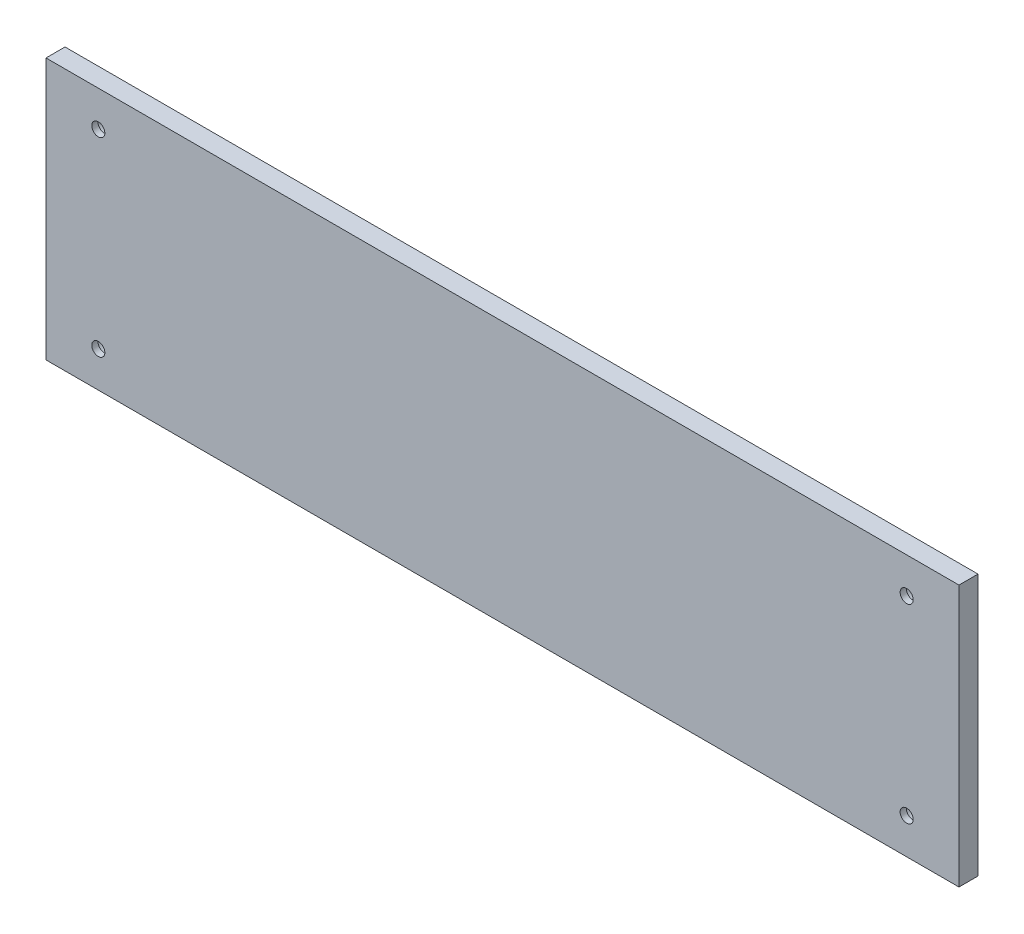
ISO-10303-21;
HEADER;
FILE_DESCRIPTION(('STEP AP214'),'2;1');
FILE_NAME('part.step','',(''),(''),'','','');
FILE_SCHEMA(('AUTOMOTIVE_DESIGN { 1 0 10303 214 1 1 1 1 }'));
ENDSEC;
DATA;
#1=APPLICATION_CONTEXT('core data for automotive mechanical design processes');
#2=APPLICATION_PROTOCOL_DEFINITION('international standard','automotive_design',2000,#1);
#3=PRODUCT_CONTEXT('',#1,'mechanical');
#4=PRODUCT('Part','Part','',(#3));
#5=PRODUCT_RELATED_PRODUCT_CATEGORY('part','',(#4));
#6=PRODUCT_DEFINITION_FORMATION('','',#4);
#7=PRODUCT_DEFINITION_CONTEXT('part definition',#1,'design');
#8=PRODUCT_DEFINITION('design','',#6,#7);
#9=PRODUCT_DEFINITION_SHAPE('','',#8);
#10=(LENGTH_UNIT() NAMED_UNIT(*) SI_UNIT(.MILLI.,.METRE.));
#11=(NAMED_UNIT(*) PLANE_ANGLE_UNIT() SI_UNIT($,.RADIAN.));
#12=(NAMED_UNIT(*) SI_UNIT($,.STERADIAN.) SOLID_ANGLE_UNIT());
#13=UNCERTAINTY_MEASURE_WITH_UNIT(LENGTH_MEASURE(1.E-05),#10,'distance_accuracy_value','');
#14=(GEOMETRIC_REPRESENTATION_CONTEXT(3) GLOBAL_UNCERTAINTY_ASSIGNED_CONTEXT((#13)) GLOBAL_UNIT_ASSIGNED_CONTEXT((#10,
#11,#12)) REPRESENTATION_CONTEXT('',''));
#15=CARTESIAN_POINT('',(0.,0.,0.));
#16=DIRECTION('',(0.,0.,1.));
#17=DIRECTION('',(1.,0.,0.));
#18=AXIS2_PLACEMENT_3D('',#15,#16,#17);
#19=CARTESIAN_POINT('',(0.,0.,8.));
#20=DIRECTION('',(1.,0.,0.));
#21=DIRECTION('',(0.,0.,-1.));
#22=AXIS2_PLACEMENT_3D('',#19,#20,#21);
#23=PLANE('',#22);
#24=DIRECTION('',(0.,-1.,0.));
#25=VECTOR('',#24,1.);
#26=CARTESIAN_POINT('',(0.,0.,0.));
#27=LINE('',#26,#25);
#28=CARTESIAN_POINT('',(0.,110.,0.));
#29=VERTEX_POINT('',#28);
#30=CARTESIAN_POINT('',(0.,0.,0.));
#31=VERTEX_POINT('',#30);
#32=EDGE_CURVE('E94',#29,#31,#27,.T.);
#33=ORIENTED_EDGE('',*,*,#32,.T.);
#34=DIRECTION('',(0.,0.,-1.));
#35=VECTOR('',#34,1.);
#36=CARTESIAN_POINT('',(0.,0.,8.));
#37=LINE('',#36,#35);
#38=CARTESIAN_POINT('',(0.,0.,8.));
#39=VERTEX_POINT('',#38);
#40=EDGE_CURVE('E11',#39,#31,#37,.T.);
#41=ORIENTED_EDGE('',*,*,#40,.F.);
#42=DIRECTION('',(0.,-1.,0.));
#43=VECTOR('',#42,1.);
#44=CARTESIAN_POINT('',(0.,0.,8.));
#45=LINE('',#44,#43);
#46=CARTESIAN_POINT('',(0.,110.,8.));
#47=VERTEX_POINT('',#46);
#48=EDGE_CURVE('E82',#47,#39,#45,.T.);
#49=ORIENTED_EDGE('',*,*,#48,.F.);
#50=DIRECTION('',(0.,0.,-1.));
#51=VECTOR('',#50,1.);
#52=CARTESIAN_POINT('',(0.,110.,8.));
#53=LINE('',#52,#51);
#54=EDGE_CURVE('E90',#47,#29,#53,.T.);
#55=ORIENTED_EDGE('',*,*,#54,.T.);
#56=EDGE_LOOP('',(#33,#41,#49,#55));
#57=FACE_BOUND('',#56,.T.);
#58=ADVANCED_FACE('F31',(#57),#23,.F.);
#59=CARTESIAN_POINT('',(0.,0.,8.));
#60=DIRECTION('',(0.,1.,0.));
#61=DIRECTION('',(0.,0.,1.));
#62=AXIS2_PLACEMENT_3D('',#59,#60,#61);
#63=PLANE('',#62);
#64=DIRECTION('',(1.,0.,0.));
#65=VECTOR('',#64,1.);
#66=CARTESIAN_POINT('',(0.,0.,0.));
#67=LINE('',#66,#65);
#68=CARTESIAN_POINT('',(384.,0.,0.));
#69=VERTEX_POINT('',#68);
#70=EDGE_CURVE('E86',#31,#69,#67,.T.);
#71=ORIENTED_EDGE('',*,*,#70,.T.);
#72=DIRECTION('',(0.,0.,-1.));
#73=VECTOR('',#72,1.);
#74=CARTESIAN_POINT('',(384.,0.,8.));
#75=LINE('',#74,#73);
#76=CARTESIAN_POINT('',(384.,0.,8.));
#77=VERTEX_POINT('',#76);
#78=EDGE_CURVE('E39',#77,#69,#75,.T.);
#79=ORIENTED_EDGE('',*,*,#78,.F.);
#80=DIRECTION('',(1.,0.,0.));
#81=VECTOR('',#80,1.);
#82=CARTESIAN_POINT('',(0.,0.,8.));
#83=LINE('',#82,#81);
#84=EDGE_CURVE('E77',#39,#77,#83,.T.);
#85=ORIENTED_EDGE('',*,*,#84,.F.);
#86=ORIENTED_EDGE('',*,*,#40,.T.);
#87=EDGE_LOOP('',(#71,#79,#85,#86));
#88=FACE_BOUND('',#87,.T.);
#89=ADVANCED_FACE('F85',(#88),#63,.F.);
#90=CARTESIAN_POINT('',(384.,0.,8.));
#91=DIRECTION('',(-1.,0.,0.));
#92=DIRECTION('',(0.,0.,1.));
#93=AXIS2_PLACEMENT_3D('',#90,#91,#92);
#94=PLANE('',#93);
#95=DIRECTION('',(0.,1.,0.));
#96=VECTOR('',#95,1.);
#97=CARTESIAN_POINT('',(384.,0.,0.));
#98=LINE('',#97,#96);
#99=CARTESIAN_POINT('',(384.,110.,0.));
#100=VERTEX_POINT('',#99);
#101=EDGE_CURVE('E64',#69,#100,#98,.T.);
#102=ORIENTED_EDGE('',*,*,#101,.T.);
#103=DIRECTION('',(0.,0.,-1.));
#104=VECTOR('',#103,1.);
#105=CARTESIAN_POINT('',(384.,110.,8.));
#106=LINE('',#105,#104);
#107=CARTESIAN_POINT('',(384.,110.,8.));
#108=VERTEX_POINT('',#107);
#109=EDGE_CURVE('E87',#108,#100,#106,.T.);
#110=ORIENTED_EDGE('',*,*,#109,.F.);
#111=DIRECTION('',(0.,1.,0.));
#112=VECTOR('',#111,1.);
#113=CARTESIAN_POINT('',(384.,0.,8.));
#114=LINE('',#113,#112);
#115=EDGE_CURVE('E80',#77,#108,#114,.T.);
#116=ORIENTED_EDGE('',*,*,#115,.F.);
#117=ORIENTED_EDGE('',*,*,#78,.T.);
#118=EDGE_LOOP('',(#102,#110,#116,#117));
#119=FACE_BOUND('',#118,.T.);
#120=ADVANCED_FACE('F88',(#119),#94,.F.);
#121=CARTESIAN_POINT('',(0.,110.,8.));
#122=DIRECTION('',(0.,-1.,0.));
#123=DIRECTION('',(0.,0.,-1.));
#124=AXIS2_PLACEMENT_3D('',#121,#122,#123);
#125=PLANE('',#124);
#126=DIRECTION('',(-1.,0.,0.));
#127=VECTOR('',#126,1.);
#128=CARTESIAN_POINT('',(0.,110.,0.));
#129=LINE('',#128,#127);
#130=EDGE_CURVE('E70',#100,#29,#129,.T.);
#131=ORIENTED_EDGE('',*,*,#130,.T.);
#132=ORIENTED_EDGE('',*,*,#54,.F.);
#133=DIRECTION('',(-1.,0.,0.));
#134=VECTOR('',#133,1.);
#135=CARTESIAN_POINT('',(0.,110.,8.));
#136=LINE('',#135,#134);
#137=EDGE_CURVE('E47',#108,#47,#136,.T.);
#138=ORIENTED_EDGE('',*,*,#137,.F.);
#139=ORIENTED_EDGE('',*,*,#109,.T.);
#140=EDGE_LOOP('',(#131,#132,#138,#139));
#141=FACE_BOUND('',#140,.T.);
#142=ADVANCED_FACE('F102',(#141),#125,.F.);
#143=CARTESIAN_POINT('',(0.,110.,8.));
#144=DIRECTION('',(0.,0.,-1.));
#145=DIRECTION('',(-1.,0.,0.));
#146=AXIS2_PLACEMENT_3D('',#143,#144,#145);
#147=PLANE('',#146);
#148=CARTESIAN_POINT('',(362.,95.,7.99999999999999));
#149=DIRECTION('',(0.,0.,-1.));
#150=DIRECTION('',(-1.,0.,0.));
#151=AXIS2_PLACEMENT_3D('',#148,#149,#150);
#152=CIRCLE('',#151,2.75000000000003);
#153=CARTESIAN_POINT('',(359.25,95.,7.99999999999999));
#154=VERTEX_POINT('',#153);
#155=EDGE_CURVE('E152',#154,#154,#152,.T.);
#156=ORIENTED_EDGE('',*,*,#155,.T.);
#157=EDGE_LOOP('',(#156));
#158=FACE_BOUND('',#157,.T.);
#159=CARTESIAN_POINT('',(22.,95.,7.99999999999999));
#160=DIRECTION('',(0.,0.,-1.));
#161=DIRECTION('',(-1.,0.,0.));
#162=AXIS2_PLACEMENT_3D('',#159,#160,#161);
#163=CIRCLE('',#162,2.75000000000001);
#164=CARTESIAN_POINT('',(19.25,95.,7.99999999999999));
#165=VERTEX_POINT('',#164);
#166=EDGE_CURVE('E140',#165,#165,#163,.T.);
#167=ORIENTED_EDGE('',*,*,#166,.T.);
#168=EDGE_LOOP('',(#167));
#169=FACE_BOUND('',#168,.T.);
#170=CARTESIAN_POINT('',(21.9999999999998,15.,7.99999999999999));
#171=DIRECTION('',(0.,0.,-1.));
#172=DIRECTION('',(-1.,0.,0.));
#173=AXIS2_PLACEMENT_3D('',#170,#171,#172);
#174=CIRCLE('',#173,2.75000000000001);
#175=CARTESIAN_POINT('',(19.2499999999998,15.,7.99999999999999));
#176=VERTEX_POINT('',#175);
#177=EDGE_CURVE('E128',#176,#176,#174,.T.);
#178=ORIENTED_EDGE('',*,*,#177,.T.);
#179=EDGE_LOOP('',(#178));
#180=FACE_BOUND('',#179,.T.);
#181=CARTESIAN_POINT('',(362.,15.,7.99999999999999));
#182=DIRECTION('',(0.,0.,-1.));
#183=DIRECTION('',(-1.,0.,0.));
#184=AXIS2_PLACEMENT_3D('',#181,#182,#183);
#185=CIRCLE('',#184,2.75000000000003);
#186=CARTESIAN_POINT('',(359.25,15.,7.99999999999999));
#187=VERTEX_POINT('',#186);
#188=EDGE_CURVE('E116',#187,#187,#185,.T.);
#189=ORIENTED_EDGE('',*,*,#188,.T.);
#190=EDGE_LOOP('',(#189));
#191=FACE_BOUND('',#190,.T.);
#192=ORIENTED_EDGE('',*,*,#48,.T.);
#193=ORIENTED_EDGE('',*,*,#84,.T.);
#194=ORIENTED_EDGE('',*,*,#115,.T.);
#195=ORIENTED_EDGE('',*,*,#137,.T.);
#196=EDGE_LOOP('',(#192,#193,#194,#195));
#197=FACE_BOUND('',#196,.T.);
#198=ADVANCED_FACE('F78',(#158,#169,#180,#191,#197),#147,.F.);
#199=CARTESIAN_POINT('',(0.,110.,0.));
#200=DIRECTION('',(0.,0.,-1.));
#201=DIRECTION('',(-1.,0.,0.));
#202=AXIS2_PLACEMENT_3D('',#199,#200,#201);
#203=PLANE('',#202);
#204=CARTESIAN_POINT('',(362.,95.,0.));
#205=DIRECTION('',(0.,0.,-1.));
#206=DIRECTION('',(-1.,0.,0.));
#207=AXIS2_PLACEMENT_3D('',#204,#205,#206);
#208=CIRCLE('',#207,5.);
#209=CARTESIAN_POINT('',(357.,95.,0.));
#210=VERTEX_POINT('',#209);
#211=EDGE_CURVE('E143',#210,#210,#208,.T.);
#212=ORIENTED_EDGE('',*,*,#211,.F.);
#213=EDGE_LOOP('',(#212));
#214=FACE_BOUND('',#213,.T.);
#215=CARTESIAN_POINT('',(22.,95.,0.));
#216=DIRECTION('',(0.,0.,-1.));
#217=DIRECTION('',(-1.,0.,0.));
#218=AXIS2_PLACEMENT_3D('',#215,#216,#217);
#219=CIRCLE('',#218,4.99999999999999);
#220=CARTESIAN_POINT('',(17.,95.,0.));
#221=VERTEX_POINT('',#220);
#222=EDGE_CURVE('E131',#221,#221,#219,.T.);
#223=ORIENTED_EDGE('',*,*,#222,.F.);
#224=EDGE_LOOP('',(#223));
#225=FACE_BOUND('',#224,.T.);
#226=CARTESIAN_POINT('',(21.9999999999998,15.,0.));
#227=DIRECTION('',(0.,0.,-1.));
#228=DIRECTION('',(-1.,0.,0.));
#229=AXIS2_PLACEMENT_3D('',#226,#227,#228);
#230=CIRCLE('',#229,4.99999999999999);
#231=CARTESIAN_POINT('',(16.9999999999998,15.,0.));
#232=VERTEX_POINT('',#231);
#233=EDGE_CURVE('E119',#232,#232,#230,.T.);
#234=ORIENTED_EDGE('',*,*,#233,.F.);
#235=EDGE_LOOP('',(#234));
#236=FACE_BOUND('',#235,.T.);
#237=CARTESIAN_POINT('',(362.,15.,0.));
#238=DIRECTION('',(0.,0.,-1.));
#239=DIRECTION('',(-1.,0.,0.));
#240=AXIS2_PLACEMENT_3D('',#237,#238,#239);
#241=CIRCLE('',#240,5.);
#242=CARTESIAN_POINT('',(357.,15.,0.));
#243=VERTEX_POINT('',#242);
#244=EDGE_CURVE('E97',#243,#243,#241,.T.);
#245=ORIENTED_EDGE('',*,*,#244,.F.);
#246=EDGE_LOOP('',(#245));
#247=FACE_BOUND('',#246,.T.);
#248=ORIENTED_EDGE('',*,*,#32,.F.);
#249=ORIENTED_EDGE('',*,*,#130,.F.);
#250=ORIENTED_EDGE('',*,*,#101,.F.);
#251=ORIENTED_EDGE('',*,*,#70,.F.);
#252=EDGE_LOOP('',(#248,#249,#250,#251));
#253=FACE_BOUND('',#252,.T.);
#254=ADVANCED_FACE('F105',(#214,#225,#236,#247,#253),#203,.T.);
#255=CARTESIAN_POINT('',(362.,15.,0.));
#256=DIRECTION('',(0.,0.,-1.));
#257=DIRECTION('',(-1.,0.,0.));
#258=AXIS2_PLACEMENT_3D('',#255,#256,#257);
#259=CYLINDRICAL_SURFACE('',#258,5.);
#260=CARTESIAN_POINT('',(362.,15.,5.4));
#261=DIRECTION('',(0.,0.,-1.));
#262=DIRECTION('',(-1.,0.,0.));
#263=AXIS2_PLACEMENT_3D('',#260,#261,#262);
#264=CIRCLE('',#263,5.);
#265=CARTESIAN_POINT('',(357.,15.,5.4));
#266=VERTEX_POINT('',#265);
#267=EDGE_CURVE('E110',#266,#266,#264,.T.);
#268=ORIENTED_EDGE('',*,*,#267,.F.);
#269=EDGE_LOOP('',(#268));
#270=FACE_BOUND('',#269,.T.);
#271=ORIENTED_EDGE('',*,*,#244,.T.);
#272=EDGE_LOOP('',(#271));
#273=FACE_BOUND('',#272,.T.);
#274=ADVANCED_FACE('F179',(#270,#273),#259,.F.);
#275=CARTESIAN_POINT('',(364.75,15.,5.4));
#276=DIRECTION('',(0.,0.,1.));
#277=DIRECTION('',(1.,0.,0.));
#278=AXIS2_PLACEMENT_3D('',#275,#276,#277);
#279=PLANE('',#278);
#280=CARTESIAN_POINT('',(362.,15.,5.4));
#281=DIRECTION('',(0.,0.,-1.));
#282=DIRECTION('',(-1.,0.,0.));
#283=AXIS2_PLACEMENT_3D('',#280,#281,#282);
#284=CIRCLE('',#283,2.75000000000003);
#285=CARTESIAN_POINT('',(359.25,15.,5.4));
#286=VERTEX_POINT('',#285);
#287=EDGE_CURVE('E113',#286,#286,#284,.T.);
#288=ORIENTED_EDGE('',*,*,#287,.F.);
#289=EDGE_LOOP('',(#288));
#290=FACE_BOUND('',#289,.T.);
#291=ORIENTED_EDGE('',*,*,#267,.T.);
#292=EDGE_LOOP('',(#291));
#293=FACE_BOUND('',#292,.T.);
#294=ADVANCED_FACE('F188',(#290,#293),#279,.F.);
#295=CARTESIAN_POINT('',(362.,15.,0.));
#296=DIRECTION('',(0.,0.,-1.));
#297=DIRECTION('',(-1.,0.,0.));
#298=AXIS2_PLACEMENT_3D('',#295,#296,#297);
#299=CYLINDRICAL_SURFACE('',#298,2.75000000000003);
#300=ORIENTED_EDGE('',*,*,#188,.F.);
#301=EDGE_LOOP('',(#300));
#302=FACE_BOUND('',#301,.T.);
#303=ORIENTED_EDGE('',*,*,#287,.T.);
#304=EDGE_LOOP('',(#303));
#305=FACE_BOUND('',#304,.T.);
#306=ADVANCED_FACE('F194',(#302,#305),#299,.F.);
#307=CARTESIAN_POINT('',(21.9999999999998,15.,0.));
#308=DIRECTION('',(0.,0.,-1.));
#309=DIRECTION('',(-1.,0.,0.));
#310=AXIS2_PLACEMENT_3D('',#307,#308,#309);
#311=CYLINDRICAL_SURFACE('',#310,4.99999999999999);
#312=CARTESIAN_POINT('',(21.9999999999998,15.,5.4));
#313=DIRECTION('',(0.,0.,-1.));
#314=DIRECTION('',(-1.,0.,0.));
#315=AXIS2_PLACEMENT_3D('',#312,#313,#314);
#316=CIRCLE('',#315,4.99999999999999);
#317=CARTESIAN_POINT('',(16.9999999999998,15.,5.4));
#318=VERTEX_POINT('',#317);
#319=EDGE_CURVE('E122',#318,#318,#316,.T.);
#320=ORIENTED_EDGE('',*,*,#319,.F.);
#321=EDGE_LOOP('',(#320));
#322=FACE_BOUND('',#321,.T.);
#323=ORIENTED_EDGE('',*,*,#233,.T.);
#324=EDGE_LOOP('',(#323));
#325=FACE_BOUND('',#324,.T.);
#326=ADVANCED_FACE('F237',(#322,#325),#311,.F.);
#327=CARTESIAN_POINT('',(24.7499999999998,15.,5.4));
#328=DIRECTION('',(0.,0.,1.));
#329=DIRECTION('',(1.,0.,0.));
#330=AXIS2_PLACEMENT_3D('',#327,#328,#329);
#331=PLANE('',#330);
#332=CARTESIAN_POINT('',(21.9999999999998,15.,5.4));
#333=DIRECTION('',(0.,0.,-1.));
#334=DIRECTION('',(-1.,0.,0.));
#335=AXIS2_PLACEMENT_3D('',#332,#333,#334);
#336=CIRCLE('',#335,2.75000000000001);
#337=CARTESIAN_POINT('',(19.2499999999998,15.,5.4));
#338=VERTEX_POINT('',#337);
#339=EDGE_CURVE('E125',#338,#338,#336,.T.);
#340=ORIENTED_EDGE('',*,*,#339,.F.);
#341=EDGE_LOOP('',(#340));
#342=FACE_BOUND('',#341,.T.);
#343=ORIENTED_EDGE('',*,*,#319,.T.);
#344=EDGE_LOOP('',(#343));
#345=FACE_BOUND('',#344,.T.);
#346=ADVANCED_FACE('F247',(#342,#345),#331,.F.);
#347=CARTESIAN_POINT('',(21.9999999999998,15.,0.));
#348=DIRECTION('',(0.,0.,-1.));
#349=DIRECTION('',(-1.,0.,0.));
#350=AXIS2_PLACEMENT_3D('',#347,#348,#349);
#351=CYLINDRICAL_SURFACE('',#350,2.75000000000001);
#352=ORIENTED_EDGE('',*,*,#177,.F.);
#353=EDGE_LOOP('',(#352));
#354=FACE_BOUND('',#353,.T.);
#355=ORIENTED_EDGE('',*,*,#339,.T.);
#356=EDGE_LOOP('',(#355));
#357=FACE_BOUND('',#356,.T.);
#358=ADVANCED_FACE('F257',(#354,#357),#351,.F.);
#359=CARTESIAN_POINT('',(22.,95.,0.));
#360=DIRECTION('',(0.,0.,-1.));
#361=DIRECTION('',(-1.,0.,0.));
#362=AXIS2_PLACEMENT_3D('',#359,#360,#361);
#363=CYLINDRICAL_SURFACE('',#362,4.99999999999999);
#364=CARTESIAN_POINT('',(22.,95.,5.4));
#365=DIRECTION('',(0.,0.,-1.));
#366=DIRECTION('',(-1.,0.,0.));
#367=AXIS2_PLACEMENT_3D('',#364,#365,#366);
#368=CIRCLE('',#367,4.99999999999999);
#369=CARTESIAN_POINT('',(17.,95.,5.4));
#370=VERTEX_POINT('',#369);
#371=EDGE_CURVE('E134',#370,#370,#368,.T.);
#372=ORIENTED_EDGE('',*,*,#371,.F.);
#373=EDGE_LOOP('',(#372));
#374=FACE_BOUND('',#373,.T.);
#375=ORIENTED_EDGE('',*,*,#222,.T.);
#376=EDGE_LOOP('',(#375));
#377=FACE_BOUND('',#376,.T.);
#378=ADVANCED_FACE('F267',(#374,#377),#363,.F.);
#379=CARTESIAN_POINT('',(24.75,95.,5.4));
#380=DIRECTION('',(0.,0.,1.));
#381=DIRECTION('',(1.,0.,0.));
#382=AXIS2_PLACEMENT_3D('',#379,#380,#381);
#383=PLANE('',#382);
#384=CARTESIAN_POINT('',(22.,95.,5.4));
#385=DIRECTION('',(0.,0.,-1.));
#386=DIRECTION('',(-1.,0.,0.));
#387=AXIS2_PLACEMENT_3D('',#384,#385,#386);
#388=CIRCLE('',#387,2.75000000000001);
#389=CARTESIAN_POINT('',(19.25,95.,5.4));
#390=VERTEX_POINT('',#389);
#391=EDGE_CURVE('E137',#390,#390,#388,.T.);
#392=ORIENTED_EDGE('',*,*,#391,.F.);
#393=EDGE_LOOP('',(#392));
#394=FACE_BOUND('',#393,.T.);
#395=ORIENTED_EDGE('',*,*,#371,.T.);
#396=EDGE_LOOP('',(#395));
#397=FACE_BOUND('',#396,.T.);
#398=ADVANCED_FACE('F277',(#394,#397),#383,.F.);
#399=CARTESIAN_POINT('',(22.,95.,0.));
#400=DIRECTION('',(0.,0.,-1.));
#401=DIRECTION('',(-1.,0.,0.));
#402=AXIS2_PLACEMENT_3D('',#399,#400,#401);
#403=CYLINDRICAL_SURFACE('',#402,2.75000000000001);
#404=ORIENTED_EDGE('',*,*,#166,.F.);
#405=EDGE_LOOP('',(#404));
#406=FACE_BOUND('',#405,.T.);
#407=ORIENTED_EDGE('',*,*,#391,.T.);
#408=EDGE_LOOP('',(#407));
#409=FACE_BOUND('',#408,.T.);
#410=ADVANCED_FACE('F173',(#406,#409),#403,.F.);
#411=CARTESIAN_POINT('',(362.,95.,0.));
#412=DIRECTION('',(0.,0.,-1.));
#413=DIRECTION('',(-1.,0.,0.));
#414=AXIS2_PLACEMENT_3D('',#411,#412,#413);
#415=CYLINDRICAL_SURFACE('',#414,5.);
#416=CARTESIAN_POINT('',(362.,95.,5.4));
#417=DIRECTION('',(0.,0.,-1.));
#418=DIRECTION('',(-1.,0.,0.));
#419=AXIS2_PLACEMENT_3D('',#416,#417,#418);
#420=CIRCLE('',#419,5.);
#421=CARTESIAN_POINT('',(357.,95.,5.4));
#422=VERTEX_POINT('',#421);
#423=EDGE_CURVE('E146',#422,#422,#420,.T.);
#424=ORIENTED_EDGE('',*,*,#423,.F.);
#425=EDGE_LOOP('',(#424));
#426=FACE_BOUND('',#425,.T.);
#427=ORIENTED_EDGE('',*,*,#211,.T.);
#428=EDGE_LOOP('',(#427));
#429=FACE_BOUND('',#428,.T.);
#430=ADVANCED_FACE('F167',(#426,#429),#415,.F.);
#431=CARTESIAN_POINT('',(364.75,95.,5.4));
#432=DIRECTION('',(0.,0.,1.));
#433=DIRECTION('',(1.,0.,0.));
#434=AXIS2_PLACEMENT_3D('',#431,#432,#433);
#435=PLANE('',#434);
#436=CARTESIAN_POINT('',(362.,95.,5.4));
#437=DIRECTION('',(0.,0.,-1.));
#438=DIRECTION('',(-1.,0.,0.));
#439=AXIS2_PLACEMENT_3D('',#436,#437,#438);
#440=CIRCLE('',#439,2.75000000000003);
#441=CARTESIAN_POINT('',(359.25,95.,5.4));
#442=VERTEX_POINT('',#441);
#443=EDGE_CURVE('E149',#442,#442,#440,.T.);
#444=ORIENTED_EDGE('',*,*,#443,.F.);
#445=EDGE_LOOP('',(#444));
#446=FACE_BOUND('',#445,.T.);
#447=ORIENTED_EDGE('',*,*,#423,.T.);
#448=EDGE_LOOP('',(#447));
#449=FACE_BOUND('',#448,.T.);
#450=ADVANCED_FACE('F161',(#446,#449),#435,.F.);
#451=CARTESIAN_POINT('',(362.,95.,0.));
#452=DIRECTION('',(0.,0.,-1.));
#453=DIRECTION('',(-1.,0.,0.));
#454=AXIS2_PLACEMENT_3D('',#451,#452,#453);
#455=CYLINDRICAL_SURFACE('',#454,2.75000000000003);
#456=ORIENTED_EDGE('',*,*,#155,.F.);
#457=EDGE_LOOP('',(#456));
#458=FACE_BOUND('',#457,.T.);
#459=ORIENTED_EDGE('',*,*,#443,.T.);
#460=EDGE_LOOP('',(#459));
#461=FACE_BOUND('',#460,.T.);
#462=ADVANCED_FACE('F158',(#458,#461),#455,.F.);
#463=CLOSED_SHELL('',(#58,#89,#120,#142,#198,#254,#274,#294,#306,#326,#346,#358,#378,#398,#410,
#430,#450,#462));
#464=MANIFOLD_SOLID_BREP('B2',#463);
#465=ADVANCED_BREP_SHAPE_REPRESENTATION('',(#18,#464),#14);
#466=SHAPE_DEFINITION_REPRESENTATION(#9,#465);
ENDSEC;
END-ISO-10303-21;
